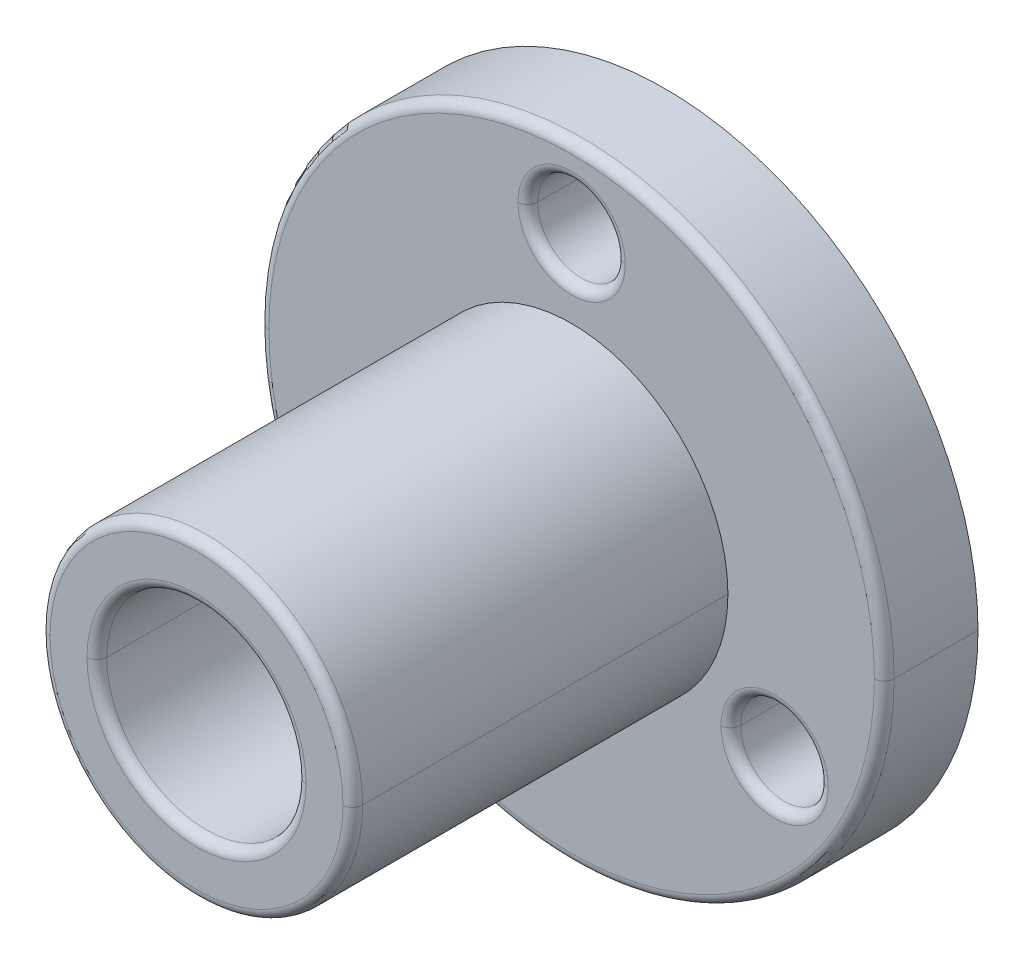
ISO-10303-21;
HEADER;
FILE_DESCRIPTION(('STEP AP214'),'2;1');
FILE_NAME('part.step','',(''),(''),'','','');
FILE_SCHEMA(('AUTOMOTIVE_DESIGN { 1 0 10303 214 1 1 1 1 }'));
ENDSEC;
DATA;
#1=APPLICATION_CONTEXT('core data for automotive mechanical design processes');
#2=APPLICATION_PROTOCOL_DEFINITION('international standard','automotive_design',2000,#1);
#3=PRODUCT_CONTEXT('',#1,'mechanical');
#4=PRODUCT('Part','Part','',(#3));
#5=PRODUCT_RELATED_PRODUCT_CATEGORY('part','',(#4));
#6=PRODUCT_DEFINITION_FORMATION('','',#4);
#7=PRODUCT_DEFINITION_CONTEXT('part definition',#1,'design');
#8=PRODUCT_DEFINITION('design','',#6,#7);
#9=PRODUCT_DEFINITION_SHAPE('','',#8);
#10=(LENGTH_UNIT() NAMED_UNIT(*) SI_UNIT(.MILLI.,.METRE.));
#11=(NAMED_UNIT(*) PLANE_ANGLE_UNIT() SI_UNIT($,.RADIAN.));
#12=(NAMED_UNIT(*) SI_UNIT($,.STERADIAN.) SOLID_ANGLE_UNIT());
#13=UNCERTAINTY_MEASURE_WITH_UNIT(LENGTH_MEASURE(1.E-05),#10,'distance_accuracy_value','');
#14=(GEOMETRIC_REPRESENTATION_CONTEXT(3) GLOBAL_UNCERTAINTY_ASSIGNED_CONTEXT((#13)) GLOBAL_UNIT_ASSIGNED_CONTEXT((#10,
#11,#12)) REPRESENTATION_CONTEXT('',''));
#15=CARTESIAN_POINT('',(0.,0.,0.));
#16=DIRECTION('',(0.,0.,1.));
#17=DIRECTION('',(1.,0.,0.));
#18=AXIS2_PLACEMENT_3D('',#15,#16,#17);
#19=CARTESIAN_POINT('',(0.,0.,102.65));
#20=DIRECTION('',(0.,0.,1.));
#21=DIRECTION('',(1.,0.,0.));
#22=AXIS2_PLACEMENT_3D('',#19,#20,#21);
#23=TOROIDAL_SURFACE('',#22,5.95,0.4);
#24=CARTESIAN_POINT('',(-5.95,0.,102.65));
#25=DIRECTION('',(0.,1.,0.));
#26=DIRECTION('',(-1.,0.,0.));
#27=AXIS2_PLACEMENT_3D('',#24,#25,#26);
#28=CIRCLE('',#27,0.4);
#29=CARTESIAN_POINT('',(-6.35,0.,102.65));
#30=VERTEX_POINT('',#29);
#31=CARTESIAN_POINT('',(-5.95,0.,103.05));
#32=VERTEX_POINT('',#31);
#33=EDGE_CURVE('E223',#30,#32,#28,.T.);
#34=ORIENTED_EDGE('',*,*,#33,.F.);
#35=CARTESIAN_POINT('',(0.,0.,102.65));
#36=DIRECTION('',(0.,0.,-1.));
#37=DIRECTION('',(1.,0.,0.));
#38=AXIS2_PLACEMENT_3D('',#35,#36,#37);
#39=CIRCLE('',#38,6.35);
#40=CARTESIAN_POINT('',(6.35,0.,102.65));
#41=VERTEX_POINT('',#40);
#42=EDGE_CURVE('E11',#41,#30,#39,.T.);
#43=ORIENTED_EDGE('',*,*,#42,.F.);
#44=CARTESIAN_POINT('',(5.95,0.,102.65));
#45=DIRECTION('',(0.,-1.,0.));
#46=DIRECTION('',(0.,0.,-1.));
#47=AXIS2_PLACEMENT_3D('',#44,#45,#46);
#48=CIRCLE('',#47,0.4);
#49=CARTESIAN_POINT('',(5.95,0.,103.05));
#50=VERTEX_POINT('',#49);
#51=EDGE_CURVE('E214',#41,#50,#48,.T.);
#52=ORIENTED_EDGE('',*,*,#51,.T.);
#53=CARTESIAN_POINT('',(0.,0.,103.05));
#54=DIRECTION('',(0.,0.,1.));
#55=DIRECTION('',(1.,0.,0.));
#56=AXIS2_PLACEMENT_3D('',#53,#54,#55);
#57=CIRCLE('',#56,5.95);
#58=EDGE_CURVE('E202',#32,#50,#57,.T.);
#59=ORIENTED_EDGE('',*,*,#58,.F.);
#60=EDGE_LOOP('',(#34,#43,#52,#59));
#61=FACE_BOUND('',#60,.T.);
#62=ADVANCED_FACE('F17',(#61),#23,.T.);
#63=CARTESIAN_POINT('',(0.,0.,102.65));
#64=DIRECTION('',(0.,0.,1.));
#65=DIRECTION('',(1.,0.,0.));
#66=AXIS2_PLACEMENT_3D('',#63,#64,#65);
#67=TOROIDAL_SURFACE('',#66,4.45,0.4);
#68=CARTESIAN_POINT('',(-4.45,0.,102.65));
#69=DIRECTION('',(0.,1.,0.));
#70=DIRECTION('',(-1.,0.,0.));
#71=AXIS2_PLACEMENT_3D('',#68,#69,#70);
#72=CIRCLE('',#71,0.4);
#73=CARTESIAN_POINT('',(-4.45,0.,103.05));
#74=VERTEX_POINT('',#73);
#75=CARTESIAN_POINT('',(-4.05,0.,102.65));
#76=VERTEX_POINT('',#75);
#77=EDGE_CURVE('E292',#74,#76,#72,.T.);
#78=ORIENTED_EDGE('',*,*,#77,.F.);
#79=CARTESIAN_POINT('',(0.,0.,103.05));
#80=DIRECTION('',(0.,0.,-1.));
#81=DIRECTION('',(1.,0.,0.));
#82=AXIS2_PLACEMENT_3D('',#79,#80,#81);
#83=CIRCLE('',#82,4.45);
#84=CARTESIAN_POINT('',(4.45,0.,103.05));
#85=VERTEX_POINT('',#84);
#86=EDGE_CURVE('E28',#85,#74,#83,.T.);
#87=ORIENTED_EDGE('',*,*,#86,.F.);
#88=CARTESIAN_POINT('',(4.45,0.,102.65));
#89=DIRECTION('',(0.,-1.,0.));
#90=DIRECTION('',(0.,0.,-1.));
#91=AXIS2_PLACEMENT_3D('',#88,#89,#90);
#92=CIRCLE('',#91,0.4);
#93=CARTESIAN_POINT('',(4.05,0.,102.65));
#94=VERTEX_POINT('',#93);
#95=EDGE_CURVE('E347',#85,#94,#92,.T.);
#96=ORIENTED_EDGE('',*,*,#95,.T.);
#97=CARTESIAN_POINT('',(0.,0.,102.65));
#98=DIRECTION('',(0.,0.,1.));
#99=DIRECTION('',(1.,0.,0.));
#100=AXIS2_PLACEMENT_3D('',#97,#98,#99);
#101=CIRCLE('',#100,4.05);
#102=EDGE_CURVE('E259',#76,#94,#101,.T.);
#103=ORIENTED_EDGE('',*,*,#102,.F.);
#104=EDGE_LOOP('',(#78,#87,#96,#103));
#105=FACE_BOUND('',#104,.T.);
#106=ADVANCED_FACE('F19',(#105),#67,.T.);
#107=CARTESIAN_POINT('',(0.,0.,87.41));
#108=DIRECTION('',(0.,0.,1.));
#109=DIRECTION('',(1.,0.,0.));
#110=AXIS2_PLACEMENT_3D('',#107,#108,#109);
#111=TOROIDAL_SURFACE('',#110,12.3,0.4);
#112=CARTESIAN_POINT('',(-12.3,0.,87.41));
#113=DIRECTION('',(0.,1.,0.));
#114=DIRECTION('',(-1.,0.,0.));
#115=AXIS2_PLACEMENT_3D('',#112,#113,#114);
#116=CIRCLE('',#115,0.4);
#117=CARTESIAN_POINT('',(-12.7,0.,87.41));
#118=VERTEX_POINT('',#117);
#119=CARTESIAN_POINT('',(-12.3,0.,87.81));
#120=VERTEX_POINT('',#119);
#121=EDGE_CURVE('E260',#118,#120,#116,.T.);
#122=ORIENTED_EDGE('',*,*,#121,.F.);
#123=CARTESIAN_POINT('',(0.,0.,87.41));
#124=DIRECTION('',(0.,0.,-1.));
#125=DIRECTION('',(1.,0.,0.));
#126=AXIS2_PLACEMENT_3D('',#123,#124,#125);
#127=CIRCLE('',#126,12.7);
#128=CARTESIAN_POINT('',(12.7,0.,87.41));
#129=VERTEX_POINT('',#128);
#130=EDGE_CURVE('E320',#129,#118,#127,.T.);
#131=ORIENTED_EDGE('',*,*,#130,.F.);
#132=CARTESIAN_POINT('',(12.3,0.,87.41));
#133=DIRECTION('',(0.,-1.,0.));
#134=DIRECTION('',(0.,0.,-1.));
#135=AXIS2_PLACEMENT_3D('',#132,#133,#134);
#136=CIRCLE('',#135,0.4);
#137=CARTESIAN_POINT('',(12.3,0.,87.81));
#138=VERTEX_POINT('',#137);
#139=EDGE_CURVE('E305',#129,#138,#136,.T.);
#140=ORIENTED_EDGE('',*,*,#139,.T.);
#141=CARTESIAN_POINT('',(0.,0.,87.81));
#142=DIRECTION('',(0.,0.,1.));
#143=DIRECTION('',(1.,0.,0.));
#144=AXIS2_PLACEMENT_3D('',#141,#142,#143);
#145=CIRCLE('',#144,12.3);
#146=EDGE_CURVE('E277',#120,#138,#145,.T.);
#147=ORIENTED_EDGE('',*,*,#146,.F.);
#148=EDGE_LOOP('',(#122,#131,#140,#147));
#149=FACE_BOUND('',#148,.T.);
#150=ADVANCED_FACE('F627',(#149),#111,.T.);
#151=CARTESIAN_POINT('',(0.,9.525,87.41));
#152=DIRECTION('',(0.,0.,1.));
#153=DIRECTION('',(1.,0.,0.));
#154=AXIS2_PLACEMENT_3D('',#151,#152,#153);
#155=TOROIDAL_SURFACE('',#154,2.18000000000077,0.4);
#156=CARTESIAN_POINT('',(-2.18000000000077,9.525,87.41));
#157=DIRECTION('',(0.,1.,0.));
#158=DIRECTION('',(-1.,0.,0.));
#159=AXIS2_PLACEMENT_3D('',#156,#157,#158);
#160=CIRCLE('',#159,0.4);
#161=CARTESIAN_POINT('',(-2.18000000000077,9.525,87.81));
#162=VERTEX_POINT('',#161);
#163=CARTESIAN_POINT('',(-1.78000000000077,9.525,87.41));
#164=VERTEX_POINT('',#163);
#165=EDGE_CURVE('E296',#162,#164,#160,.T.);
#166=ORIENTED_EDGE('',*,*,#165,.F.);
#167=CARTESIAN_POINT('',(0.,9.525,87.81));
#168=DIRECTION('',(0.,0.,-1.));
#169=DIRECTION('',(1.,0.,0.));
#170=AXIS2_PLACEMENT_3D('',#167,#168,#169);
#171=CIRCLE('',#170,2.18000000000077);
#172=CARTESIAN_POINT('',(2.18000000000077,9.525,87.81));
#173=VERTEX_POINT('',#172);
#174=EDGE_CURVE('E284',#173,#162,#171,.T.);
#175=ORIENTED_EDGE('',*,*,#174,.F.);
#176=CARTESIAN_POINT('',(2.18000000000077,9.525,87.41));
#177=DIRECTION('',(0.,-1.,0.));
#178=DIRECTION('',(0.,0.,-1.));
#179=AXIS2_PLACEMENT_3D('',#176,#177,#178);
#180=CIRCLE('',#179,0.4);
#181=CARTESIAN_POINT('',(1.78000000000077,9.525,87.41));
#182=VERTEX_POINT('',#181);
#183=EDGE_CURVE('E270',#173,#182,#180,.T.);
#184=ORIENTED_EDGE('',*,*,#183,.T.);
#185=CARTESIAN_POINT('',(0.,9.525,87.41));
#186=DIRECTION('',(0.,0.,1.));
#187=DIRECTION('',(1.,0.,0.));
#188=AXIS2_PLACEMENT_3D('',#185,#186,#187);
#189=CIRCLE('',#188,1.78000000000077);
#190=EDGE_CURVE('E250',#164,#182,#189,.T.);
#191=ORIENTED_EDGE('',*,*,#190,.F.);
#192=EDGE_LOOP('',(#166,#175,#184,#191));
#193=FACE_BOUND('',#192,.T.);
#194=ADVANCED_FACE('F632',(#193),#155,.T.);
#195=CARTESIAN_POINT('',(8.24889197104739,-4.76249999999964,87.41));
#196=DIRECTION('',(0.,0.,1.));
#197=DIRECTION('',(1.,0.,0.));
#198=AXIS2_PLACEMENT_3D('',#195,#196,#197);
#199=TOROIDAL_SURFACE('',#198,2.18000000000077,0.4);
#200=CARTESIAN_POINT('',(6.06889197104662,-4.76249999999964,87.41));
#201=DIRECTION('',(0.,1.,0.));
#202=DIRECTION('',(-1.,0.,0.));
#203=AXIS2_PLACEMENT_3D('',#200,#201,#202);
#204=CIRCLE('',#203,0.4);
#205=CARTESIAN_POINT('',(6.06889197104662,-4.76249999999964,87.81));
#206=VERTEX_POINT('',#205);
#207=CARTESIAN_POINT('',(6.46889197104662,-4.76249999999964,87.41));
#208=VERTEX_POINT('',#207);
#209=EDGE_CURVE('E234',#206,#208,#204,.T.);
#210=ORIENTED_EDGE('',*,*,#209,.F.);
#211=CARTESIAN_POINT('',(8.24889197104739,-4.76249999999964,87.81));
#212=DIRECTION('',(0.,0.,-1.));
#213=DIRECTION('',(1.,0.,0.));
#214=AXIS2_PLACEMENT_3D('',#211,#212,#213);
#215=CIRCLE('',#214,2.18000000000077);
#216=CARTESIAN_POINT('',(10.4288919710482,-4.76249999999964,87.81));
#217=VERTEX_POINT('',#216);
#218=EDGE_CURVE('E276',#217,#206,#215,.T.);
#219=ORIENTED_EDGE('',*,*,#218,.F.);
#220=CARTESIAN_POINT('',(10.4288919710482,-4.76249999999964,87.41));
#221=DIRECTION('',(0.,-1.,0.));
#222=DIRECTION('',(0.,0.,-1.));
#223=AXIS2_PLACEMENT_3D('',#220,#221,#222);
#224=CIRCLE('',#223,0.4);
#225=CARTESIAN_POINT('',(10.0288919710482,-4.76249999999964,87.41));
#226=VERTEX_POINT('',#225);
#227=EDGE_CURVE('E278',#217,#226,#224,.T.);
#228=ORIENTED_EDGE('',*,*,#227,.T.);
#229=CARTESIAN_POINT('',(8.24889197104739,-4.76249999999964,87.41));
#230=DIRECTION('',(0.,0.,1.));
#231=DIRECTION('',(1.,0.,0.));
#232=AXIS2_PLACEMENT_3D('',#229,#230,#231);
#233=CIRCLE('',#232,1.78000000000077);
#234=EDGE_CURVE('E352',#208,#226,#233,.T.);
#235=ORIENTED_EDGE('',*,*,#234,.F.);
#236=EDGE_LOOP('',(#210,#219,#228,#235));
#237=FACE_BOUND('',#236,.T.);
#238=ADVANCED_FACE('F450',(#237),#199,.T.);
#239=CARTESIAN_POINT('',(-8.24889197104617,-4.76250000000036,87.41));
#240=DIRECTION('',(0.,0.,1.));
#241=DIRECTION('',(1.,0.,0.));
#242=AXIS2_PLACEMENT_3D('',#239,#240,#241);
#243=TOROIDAL_SURFACE('',#242,2.18000000000077,0.4);
#244=CARTESIAN_POINT('',(-10.4288919710469,-4.76250000000036,87.41));
#245=DIRECTION('',(0.,1.,0.));
#246=DIRECTION('',(-1.,0.,0.));
#247=AXIS2_PLACEMENT_3D('',#244,#245,#246);
#248=CIRCLE('',#247,0.4);
#249=CARTESIAN_POINT('',(-10.4288919710469,-4.76250000000036,87.81));
#250=VERTEX_POINT('',#249);
#251=CARTESIAN_POINT('',(-10.0288919710469,-4.76250000000036,87.41));
#252=VERTEX_POINT('',#251);
#253=EDGE_CURVE('E332',#250,#252,#248,.T.);
#254=ORIENTED_EDGE('',*,*,#253,.F.);
#255=CARTESIAN_POINT('',(-8.24889197104617,-4.76250000000036,87.81));
#256=DIRECTION('',(0.,0.,-1.));
#257=DIRECTION('',(1.,0.,0.));
#258=AXIS2_PLACEMENT_3D('',#255,#256,#257);
#259=CIRCLE('',#258,2.18000000000077);
#260=CARTESIAN_POINT('',(-6.0688919710454,-4.76250000000036,87.81));
#261=VERTEX_POINT('',#260);
#262=EDGE_CURVE('E126',#261,#250,#259,.T.);
#263=ORIENTED_EDGE('',*,*,#262,.F.);
#264=CARTESIAN_POINT('',(-6.0688919710454,-4.76250000000036,87.41));
#265=DIRECTION('',(0.,-1.,0.));
#266=DIRECTION('',(0.,0.,-1.));
#267=AXIS2_PLACEMENT_3D('',#264,#265,#266);
#268=CIRCLE('',#267,0.4);
#269=CARTESIAN_POINT('',(-6.4688919710454,-4.76250000000036,87.41));
#270=VERTEX_POINT('',#269);
#271=EDGE_CURVE('E236',#261,#270,#268,.T.);
#272=ORIENTED_EDGE('',*,*,#271,.T.);
#273=CARTESIAN_POINT('',(-8.24889197104617,-4.76250000000036,87.41));
#274=DIRECTION('',(0.,0.,1.));
#275=DIRECTION('',(1.,0.,0.));
#276=AXIS2_PLACEMENT_3D('',#273,#274,#275);
#277=CIRCLE('',#276,1.78000000000077);
#278=EDGE_CURVE('E309',#252,#270,#277,.T.);
#279=ORIENTED_EDGE('',*,*,#278,.F.);
#280=EDGE_LOOP('',(#254,#263,#272,#279));
#281=FACE_BOUND('',#280,.T.);
#282=ADVANCED_FACE('F430',(#281),#243,.T.);
#283=CARTESIAN_POINT('',(0.,0.,103.05));
#284=DIRECTION('',(0.,0.,-1.));
#285=DIRECTION('',(-1.,0.,0.));
#286=AXIS2_PLACEMENT_3D('',#283,#284,#285);
#287=CYLINDRICAL_SURFACE('',#286,6.35);
#288=DIRECTION('',(0.,0.,-1.));
#289=VECTOR('',#288,1.);
#290=CARTESIAN_POINT('',(6.35,0.,103.05));
#291=LINE('',#290,#289);
#292=CARTESIAN_POINT('',(6.35,0.,87.81));
#293=VERTEX_POINT('',#292);
#294=EDGE_CURVE('E239',#41,#293,#291,.T.);
#295=ORIENTED_EDGE('',*,*,#294,.F.);
#296=ORIENTED_EDGE('',*,*,#42,.T.);
#297=DIRECTION('',(0.,0.,-1.));
#298=VECTOR('',#297,1.);
#299=CARTESIAN_POINT('',(-6.35,0.,103.05));
#300=LINE('',#299,#298);
#301=CARTESIAN_POINT('',(-6.35,0.,87.81));
#302=VERTEX_POINT('',#301);
#303=EDGE_CURVE('E342',#30,#302,#300,.T.);
#304=ORIENTED_EDGE('',*,*,#303,.T.);
#305=CARTESIAN_POINT('',(0.,0.,87.81));
#306=DIRECTION('',(0.,0.,1.));
#307=DIRECTION('',(1.,0.,0.));
#308=AXIS2_PLACEMENT_3D('',#305,#306,#307);
#309=CIRCLE('',#308,6.35);
#310=EDGE_CURVE('E287',#302,#293,#309,.T.);
#311=ORIENTED_EDGE('',*,*,#310,.T.);
#312=EDGE_LOOP('',(#295,#296,#304,#311));
#313=FACE_BOUND('',#312,.T.);
#314=ADVANCED_FACE('F564',(#313),#287,.T.);
#315=CARTESIAN_POINT('',(0.,0.,103.05));
#316=DIRECTION('',(0.,0.,1.));
#317=DIRECTION('',(1.,0.,0.));
#318=AXIS2_PLACEMENT_3D('',#315,#316,#317);
#319=PLANE('',#318);
#320=ORIENTED_EDGE('',*,*,#86,.T.);
#321=CARTESIAN_POINT('',(0.,0.,103.05));
#322=DIRECTION('',(0.,0.,-1.));
#323=DIRECTION('',(1.,0.,0.));
#324=AXIS2_PLACEMENT_3D('',#321,#322,#323);
#325=CIRCLE('',#324,4.45);
#326=EDGE_CURVE('E220',#74,#85,#325,.T.);
#327=ORIENTED_EDGE('',*,*,#326,.T.);
#328=EDGE_LOOP('',(#320,#327));
#329=FACE_BOUND('',#328,.T.);
#330=CARTESIAN_POINT('',(0.,0.,103.05));
#331=DIRECTION('',(0.,0.,1.));
#332=DIRECTION('',(1.,0.,0.));
#333=AXIS2_PLACEMENT_3D('',#330,#331,#332);
#334=CIRCLE('',#333,5.95);
#335=EDGE_CURVE('E206',#50,#32,#334,.T.);
#336=ORIENTED_EDGE('',*,*,#335,.T.);
#337=ORIENTED_EDGE('',*,*,#58,.T.);
#338=EDGE_LOOP('',(#336,#337));
#339=FACE_BOUND('',#338,.T.);
#340=ADVANCED_FACE('F204',(#329,#339),#319,.T.);
#341=CARTESIAN_POINT('',(0.,0.,84.));
#342=DIRECTION('',(0.,0.,1.));
#343=DIRECTION('',(1.,0.,0.));
#344=AXIS2_PLACEMENT_3D('',#341,#342,#343);
#345=PLANE('',#344);
#346=CARTESIAN_POINT('',(0.,0.,84.));
#347=DIRECTION('',(0.,0.,1.));
#348=DIRECTION('',(1.,0.,0.));
#349=AXIS2_PLACEMENT_3D('',#346,#347,#348);
#350=CIRCLE('',#349,4.05);
#351=CARTESIAN_POINT('',(-4.05,0.,84.));
#352=VERTEX_POINT('',#351);
#353=CARTESIAN_POINT('',(4.05,0.,84.));
#354=VERTEX_POINT('',#353);
#355=EDGE_CURVE('E258',#352,#354,#350,.T.);
#356=ORIENTED_EDGE('',*,*,#355,.T.);
#357=CARTESIAN_POINT('',(0.,0.,84.));
#358=DIRECTION('',(0.,0.,1.));
#359=DIRECTION('',(1.,0.,0.));
#360=AXIS2_PLACEMENT_3D('',#357,#358,#359);
#361=CIRCLE('',#360,4.05);
#362=EDGE_CURVE('E211',#354,#352,#361,.T.);
#363=ORIENTED_EDGE('',*,*,#362,.T.);
#364=EDGE_LOOP('',(#356,#363));
#365=FACE_BOUND('',#364,.T.);
#366=CARTESIAN_POINT('',(8.24889197104739,-4.76249999999964,84.));
#367=DIRECTION('',(0.,0.,1.));
#368=DIRECTION('',(1.,0.,0.));
#369=AXIS2_PLACEMENT_3D('',#366,#367,#368);
#370=CIRCLE('',#369,1.78000000000077);
#371=CARTESIAN_POINT('',(6.46889197104662,-4.76249999999964,84.));
#372=VERTEX_POINT('',#371);
#373=CARTESIAN_POINT('',(10.0288919710482,-4.76249999999964,84.));
#374=VERTEX_POINT('',#373);
#375=EDGE_CURVE('E316',#372,#374,#370,.T.);
#376=ORIENTED_EDGE('',*,*,#375,.T.);
#377=CARTESIAN_POINT('',(8.24889197104739,-4.76249999999964,84.));
#378=DIRECTION('',(0.,0.,1.));
#379=DIRECTION('',(1.,0.,0.));
#380=AXIS2_PLACEMENT_3D('',#377,#378,#379);
#381=CIRCLE('',#380,1.78000000000077);
#382=EDGE_CURVE('E21',#374,#372,#381,.T.);
#383=ORIENTED_EDGE('',*,*,#382,.T.);
#384=EDGE_LOOP('',(#376,#383));
#385=FACE_BOUND('',#384,.T.);
#386=CARTESIAN_POINT('',(0.,9.525,84.));
#387=DIRECTION('',(0.,0.,1.));
#388=DIRECTION('',(1.,0.,0.));
#389=AXIS2_PLACEMENT_3D('',#386,#387,#388);
#390=CIRCLE('',#389,1.78000000000077);
#391=CARTESIAN_POINT('',(-1.78000000000077,9.525,84.));
#392=VERTEX_POINT('',#391);
#393=CARTESIAN_POINT('',(1.78000000000077,9.525,84.));
#394=VERTEX_POINT('',#393);
#395=EDGE_CURVE('E249',#392,#394,#390,.T.);
#396=ORIENTED_EDGE('',*,*,#395,.T.);
#397=CARTESIAN_POINT('',(0.,9.525,84.));
#398=DIRECTION('',(0.,0.,1.));
#399=DIRECTION('',(1.,0.,0.));
#400=AXIS2_PLACEMENT_3D('',#397,#398,#399);
#401=CIRCLE('',#400,1.78000000000077);
#402=EDGE_CURVE('E288',#394,#392,#401,.T.);
#403=ORIENTED_EDGE('',*,*,#402,.T.);
#404=EDGE_LOOP('',(#396,#403));
#405=FACE_BOUND('',#404,.T.);
#406=CARTESIAN_POINT('',(-8.24889197104617,-4.76250000000036,84.));
#407=DIRECTION('',(0.,0.,1.));
#408=DIRECTION('',(1.,0.,0.));
#409=AXIS2_PLACEMENT_3D('',#406,#407,#408);
#410=CIRCLE('',#409,1.78000000000077);
#411=CARTESIAN_POINT('',(-10.0288919710469,-4.76250000000036,84.));
#412=VERTEX_POINT('',#411);
#413=CARTESIAN_POINT('',(-6.4688919710454,-4.76250000000036,84.));
#414=VERTEX_POINT('',#413);
#415=EDGE_CURVE('E241',#412,#414,#410,.T.);
#416=ORIENTED_EDGE('',*,*,#415,.T.);
#417=CARTESIAN_POINT('',(-8.24889197104617,-4.76250000000036,84.));
#418=DIRECTION('',(0.,0.,1.));
#419=DIRECTION('',(1.,0.,0.));
#420=AXIS2_PLACEMENT_3D('',#417,#418,#419);
#421=CIRCLE('',#420,1.78000000000077);
#422=EDGE_CURVE('E291',#414,#412,#421,.T.);
#423=ORIENTED_EDGE('',*,*,#422,.T.);
#424=EDGE_LOOP('',(#416,#423));
#425=FACE_BOUND('',#424,.T.);
#426=CARTESIAN_POINT('',(0.,0.,84.));
#427=DIRECTION('',(0.,0.,1.));
#428=DIRECTION('',(1.,0.,0.));
#429=AXIS2_PLACEMENT_3D('',#426,#427,#428);
#430=CIRCLE('',#429,12.7);
#431=CARTESIAN_POINT('',(-12.7,0.,84.));
#432=VERTEX_POINT('',#431);
#433=CARTESIAN_POINT('',(12.7,0.,84.));
#434=VERTEX_POINT('',#433);
#435=EDGE_CURVE('E42',#432,#434,#430,.T.);
#436=ORIENTED_EDGE('',*,*,#435,.F.);
#437=CARTESIAN_POINT('',(0.,0.,84.));
#438=DIRECTION('',(0.,0.,1.));
#439=DIRECTION('',(1.,0.,0.));
#440=AXIS2_PLACEMENT_3D('',#437,#438,#439);
#441=CIRCLE('',#440,12.7);
#442=EDGE_CURVE('E356',#434,#432,#441,.T.);
#443=ORIENTED_EDGE('',*,*,#442,.F.);
#444=EDGE_LOOP('',(#436,#443));
#445=FACE_BOUND('',#444,.T.);
#446=ADVANCED_FACE('F416',(#365,#385,#405,#425,#445),#345,.F.);
#447=CARTESIAN_POINT('',(0.,0.,87.81));
#448=DIRECTION('',(0.,0.,-1.));
#449=DIRECTION('',(-1.,0.,0.));
#450=AXIS2_PLACEMENT_3D('',#447,#448,#449);
#451=CYLINDRICAL_SURFACE('',#450,4.05);
#452=DIRECTION('',(0.,0.,-1.));
#453=VECTOR('',#452,1.);
#454=CARTESIAN_POINT('',(4.05,0.,87.81));
#455=LINE('',#454,#453);
#456=EDGE_CURVE('E254',#94,#354,#455,.T.);
#457=ORIENTED_EDGE('',*,*,#456,.F.);
#458=CARTESIAN_POINT('',(0.,0.,102.65));
#459=DIRECTION('',(0.,0.,1.));
#460=DIRECTION('',(1.,0.,0.));
#461=AXIS2_PLACEMENT_3D('',#458,#459,#460);
#462=CIRCLE('',#461,4.05);
#463=EDGE_CURVE('E295',#94,#76,#462,.T.);
#464=ORIENTED_EDGE('',*,*,#463,.T.);
#465=DIRECTION('',(0.,0.,-1.));
#466=VECTOR('',#465,1.);
#467=CARTESIAN_POINT('',(-4.05,0.,87.81));
#468=LINE('',#467,#466);
#469=EDGE_CURVE('E385',#76,#352,#468,.T.);
#470=ORIENTED_EDGE('',*,*,#469,.T.);
#471=ORIENTED_EDGE('',*,*,#362,.F.);
#472=EDGE_LOOP('',(#457,#464,#470,#471));
#473=FACE_BOUND('',#472,.T.);
#474=ADVANCED_FACE('F419',(#473),#451,.F.);
#475=CARTESIAN_POINT('',(-8.24889197104617,-4.76250000000036,87.81));
#476=DIRECTION('',(0.,0.,-1.));
#477=DIRECTION('',(-1.,0.,0.));
#478=AXIS2_PLACEMENT_3D('',#475,#476,#477);
#479=CYLINDRICAL_SURFACE('',#478,1.78000000000077);
#480=DIRECTION('',(0.,0.,-1.));
#481=VECTOR('',#480,1.);
#482=CARTESIAN_POINT('',(-6.4688919710454,-4.76250000000036,87.81));
#483=LINE('',#482,#481);
#484=EDGE_CURVE('E246',#270,#414,#483,.T.);
#485=ORIENTED_EDGE('',*,*,#484,.F.);
#486=CARTESIAN_POINT('',(-8.24889197104617,-4.76250000000036,87.41));
#487=DIRECTION('',(0.,0.,1.));
#488=DIRECTION('',(1.,0.,0.));
#489=AXIS2_PLACEMENT_3D('',#486,#487,#488);
#490=CIRCLE('',#489,1.78000000000077);
#491=EDGE_CURVE('E240',#270,#252,#490,.T.);
#492=ORIENTED_EDGE('',*,*,#491,.T.);
#493=DIRECTION('',(0.,0.,-1.));
#494=VECTOR('',#493,1.);
#495=CARTESIAN_POINT('',(-10.0288919710469,-4.76250000000036,87.81));
#496=LINE('',#495,#494);
#497=EDGE_CURVE('E245',#252,#412,#496,.T.);
#498=ORIENTED_EDGE('',*,*,#497,.T.);
#499=ORIENTED_EDGE('',*,*,#422,.F.);
#500=EDGE_LOOP('',(#485,#492,#498,#499));
#501=FACE_BOUND('',#500,.T.);
#502=ADVANCED_FACE('F428',(#501),#479,.F.);
#503=CARTESIAN_POINT('',(0.,9.525,87.81));
#504=DIRECTION('',(0.,0.,-1.));
#505=DIRECTION('',(-1.,0.,0.));
#506=AXIS2_PLACEMENT_3D('',#503,#504,#505);
#507=CYLINDRICAL_SURFACE('',#506,1.78000000000077);
#508=DIRECTION('',(0.,0.,-1.));
#509=VECTOR('',#508,1.);
#510=CARTESIAN_POINT('',(1.78000000000077,9.525,87.81));
#511=LINE('',#510,#509);
#512=EDGE_CURVE('E174',#182,#394,#511,.T.);
#513=ORIENTED_EDGE('',*,*,#512,.F.);
#514=CARTESIAN_POINT('',(0.,9.525,87.41));
#515=DIRECTION('',(0.,0.,1.));
#516=DIRECTION('',(1.,0.,0.));
#517=AXIS2_PLACEMENT_3D('',#514,#515,#516);
#518=CIRCLE('',#517,1.78000000000077);
#519=EDGE_CURVE('E300',#182,#164,#518,.T.);
#520=ORIENTED_EDGE('',*,*,#519,.T.);
#521=DIRECTION('',(0.,0.,-1.));
#522=VECTOR('',#521,1.);
#523=CARTESIAN_POINT('',(-1.78000000000077,9.525,87.81));
#524=LINE('',#523,#522);
#525=EDGE_CURVE('E183',#164,#392,#524,.T.);
#526=ORIENTED_EDGE('',*,*,#525,.T.);
#527=ORIENTED_EDGE('',*,*,#402,.F.);
#528=EDGE_LOOP('',(#513,#520,#526,#527));
#529=FACE_BOUND('',#528,.T.);
#530=ADVANCED_FACE('F412',(#529),#507,.F.);
#531=CARTESIAN_POINT('',(8.24889197104739,-4.76249999999964,87.81));
#532=DIRECTION('',(0.,0.,-1.));
#533=DIRECTION('',(-1.,0.,0.));
#534=AXIS2_PLACEMENT_3D('',#531,#532,#533);
#535=CYLINDRICAL_SURFACE('',#534,1.78000000000077);
#536=DIRECTION('',(0.,0.,-1.));
#537=VECTOR('',#536,1.);
#538=CARTESIAN_POINT('',(10.0288919710482,-4.76249999999964,87.81));
#539=LINE('',#538,#537);
#540=EDGE_CURVE('E348',#226,#374,#539,.T.);
#541=ORIENTED_EDGE('',*,*,#540,.F.);
#542=CARTESIAN_POINT('',(8.24889197104739,-4.76249999999964,87.41));
#543=DIRECTION('',(0.,0.,1.));
#544=DIRECTION('',(1.,0.,0.));
#545=AXIS2_PLACEMENT_3D('',#542,#543,#544);
#546=CIRCLE('',#545,1.78000000000077);
#547=EDGE_CURVE('E283',#226,#208,#546,.T.);
#548=ORIENTED_EDGE('',*,*,#547,.T.);
#549=DIRECTION('',(0.,0.,-1.));
#550=VECTOR('',#549,1.);
#551=CARTESIAN_POINT('',(6.46889197104662,-4.76249999999964,87.81));
#552=LINE('',#551,#550);
#553=EDGE_CURVE('E312',#208,#372,#552,.T.);
#554=ORIENTED_EDGE('',*,*,#553,.T.);
#555=ORIENTED_EDGE('',*,*,#382,.F.);
#556=EDGE_LOOP('',(#541,#548,#554,#555));
#557=FACE_BOUND('',#556,.T.);
#558=ADVANCED_FACE('F455',(#557),#535,.F.);
#559=CARTESIAN_POINT('',(0.,0.,87.81));
#560=DIRECTION('',(0.,0.,-1.));
#561=DIRECTION('',(-1.,0.,0.));
#562=AXIS2_PLACEMENT_3D('',#559,#560,#561);
#563=CYLINDRICAL_SURFACE('',#562,12.7);
#564=DIRECTION('',(0.,0.,-1.));
#565=VECTOR('',#564,1.);
#566=CARTESIAN_POINT('',(12.7,0.,87.81));
#567=LINE('',#566,#565);
#568=EDGE_CURVE('E315',#129,#434,#567,.T.);
#569=ORIENTED_EDGE('',*,*,#568,.F.);
#570=ORIENTED_EDGE('',*,*,#130,.T.);
#571=DIRECTION('',(0.,0.,-1.));
#572=VECTOR('',#571,1.);
#573=CARTESIAN_POINT('',(-12.7,0.,87.81));
#574=LINE('',#573,#572);
#575=EDGE_CURVE('E353',#118,#432,#574,.T.);
#576=ORIENTED_EDGE('',*,*,#575,.T.);
#577=ORIENTED_EDGE('',*,*,#435,.T.);
#578=EDGE_LOOP('',(#569,#570,#576,#577));
#579=FACE_BOUND('',#578,.T.);
#580=ADVANCED_FACE('F586',(#579),#563,.T.);
#581=CARTESIAN_POINT('',(0.,0.,87.81));
#582=DIRECTION('',(0.,0.,1.));
#583=DIRECTION('',(1.,0.,0.));
#584=AXIS2_PLACEMENT_3D('',#581,#582,#583);
#585=PLANE('',#584);
#586=ORIENTED_EDGE('',*,*,#310,.F.);
#587=CARTESIAN_POINT('',(0.,0.,87.81));
#588=DIRECTION('',(0.,0.,1.));
#589=DIRECTION('',(1.,0.,0.));
#590=AXIS2_PLACEMENT_3D('',#587,#588,#589);
#591=CIRCLE('',#590,6.35);
#592=EDGE_CURVE('E324',#293,#302,#591,.T.);
#593=ORIENTED_EDGE('',*,*,#592,.F.);
#594=EDGE_LOOP('',(#586,#593));
#595=FACE_BOUND('',#594,.T.);
#596=ORIENTED_EDGE('',*,*,#174,.T.);
#597=CARTESIAN_POINT('',(0.,9.525,87.81));
#598=DIRECTION('',(0.,0.,-1.));
#599=DIRECTION('',(1.,0.,0.));
#600=AXIS2_PLACEMENT_3D('',#597,#598,#599);
#601=CIRCLE('',#600,2.18000000000077);
#602=EDGE_CURVE('E301',#162,#173,#601,.T.);
#603=ORIENTED_EDGE('',*,*,#602,.T.);
#604=EDGE_LOOP('',(#596,#603));
#605=FACE_BOUND('',#604,.T.);
#606=ORIENTED_EDGE('',*,*,#218,.T.);
#607=CARTESIAN_POINT('',(8.24889197104739,-4.76249999999964,87.81));
#608=DIRECTION('',(0.,0.,-1.));
#609=DIRECTION('',(1.,0.,0.));
#610=AXIS2_PLACEMENT_3D('',#607,#608,#609);
#611=CIRCLE('',#610,2.18000000000077);
#612=EDGE_CURVE('E266',#206,#217,#611,.T.);
#613=ORIENTED_EDGE('',*,*,#612,.T.);
#614=EDGE_LOOP('',(#606,#613));
#615=FACE_BOUND('',#614,.T.);
#616=ORIENTED_EDGE('',*,*,#262,.T.);
#617=CARTESIAN_POINT('',(-8.24889197104617,-4.76250000000036,87.81));
#618=DIRECTION('',(0.,0.,-1.));
#619=DIRECTION('',(1.,0.,0.));
#620=AXIS2_PLACEMENT_3D('',#617,#618,#619);
#621=CIRCLE('',#620,2.18000000000077);
#622=EDGE_CURVE('E282',#250,#261,#621,.T.);
#623=ORIENTED_EDGE('',*,*,#622,.T.);
#624=EDGE_LOOP('',(#616,#623));
#625=FACE_BOUND('',#624,.T.);
#626=CARTESIAN_POINT('',(0.,0.,87.81));
#627=DIRECTION('',(0.,0.,1.));
#628=DIRECTION('',(1.,0.,0.));
#629=AXIS2_PLACEMENT_3D('',#626,#627,#628);
#630=CIRCLE('',#629,12.3);
#631=EDGE_CURVE('E264',#138,#120,#630,.T.);
#632=ORIENTED_EDGE('',*,*,#631,.T.);
#633=ORIENTED_EDGE('',*,*,#146,.T.);
#634=EDGE_LOOP('',(#632,#633));
#635=FACE_BOUND('',#634,.T.);
#636=ADVANCED_FACE('F444',(#595,#605,#615,#625,#635),#585,.T.);
#637=CARTESIAN_POINT('',(0.,0.,87.81));
#638=DIRECTION('',(0.,0.,-1.));
#639=DIRECTION('',(-1.,0.,0.));
#640=AXIS2_PLACEMENT_3D('',#637,#638,#639);
#641=CYLINDRICAL_SURFACE('',#640,12.7);
#642=CARTESIAN_POINT('',(0.,0.,87.41));
#643=DIRECTION('',(0.,0.,-1.));
#644=DIRECTION('',(1.,0.,0.));
#645=AXIS2_PLACEMENT_3D('',#642,#643,#644);
#646=CIRCLE('',#645,12.7);
#647=EDGE_CURVE('E265',#118,#129,#646,.T.);
#648=ORIENTED_EDGE('',*,*,#647,.T.);
#649=ORIENTED_EDGE('',*,*,#568,.T.);
#650=ORIENTED_EDGE('',*,*,#442,.T.);
#651=ORIENTED_EDGE('',*,*,#575,.F.);
#652=EDGE_LOOP('',(#648,#649,#650,#651));
#653=FACE_BOUND('',#652,.T.);
#654=ADVANCED_FACE('F740',(#653),#641,.T.);
#655=CARTESIAN_POINT('',(8.24889197104739,-4.76249999999964,87.81));
#656=DIRECTION('',(0.,0.,-1.));
#657=DIRECTION('',(-1.,0.,0.));
#658=AXIS2_PLACEMENT_3D('',#655,#656,#657);
#659=CYLINDRICAL_SURFACE('',#658,1.78000000000077);
#660=ORIENTED_EDGE('',*,*,#234,.T.);
#661=ORIENTED_EDGE('',*,*,#540,.T.);
#662=ORIENTED_EDGE('',*,*,#375,.F.);
#663=ORIENTED_EDGE('',*,*,#553,.F.);
#664=EDGE_LOOP('',(#660,#661,#662,#663));
#665=FACE_BOUND('',#664,.T.);
#666=ADVANCED_FACE('F458',(#665),#659,.F.);
#667=CARTESIAN_POINT('',(0.,9.525,87.81));
#668=DIRECTION('',(0.,0.,-1.));
#669=DIRECTION('',(-1.,0.,0.));
#670=AXIS2_PLACEMENT_3D('',#667,#668,#669);
#671=CYLINDRICAL_SURFACE('',#670,1.78000000000077);
#672=ORIENTED_EDGE('',*,*,#190,.T.);
#673=ORIENTED_EDGE('',*,*,#512,.T.);
#674=ORIENTED_EDGE('',*,*,#395,.F.);
#675=ORIENTED_EDGE('',*,*,#525,.F.);
#676=EDGE_LOOP('',(#672,#673,#674,#675));
#677=FACE_BOUND('',#676,.T.);
#678=ADVANCED_FACE('F414',(#677),#671,.F.);
#679=CARTESIAN_POINT('',(-8.24889197104617,-4.76250000000036,87.81));
#680=DIRECTION('',(0.,0.,-1.));
#681=DIRECTION('',(-1.,0.,0.));
#682=AXIS2_PLACEMENT_3D('',#679,#680,#681);
#683=CYLINDRICAL_SURFACE('',#682,1.78000000000077);
#684=ORIENTED_EDGE('',*,*,#278,.T.);
#685=ORIENTED_EDGE('',*,*,#484,.T.);
#686=ORIENTED_EDGE('',*,*,#415,.F.);
#687=ORIENTED_EDGE('',*,*,#497,.F.);
#688=EDGE_LOOP('',(#684,#685,#686,#687));
#689=FACE_BOUND('',#688,.T.);
#690=ADVANCED_FACE('F424',(#689),#683,.F.);
#691=CARTESIAN_POINT('',(0.,0.,87.81));
#692=DIRECTION('',(0.,0.,-1.));
#693=DIRECTION('',(-1.,0.,0.));
#694=AXIS2_PLACEMENT_3D('',#691,#692,#693);
#695=CYLINDRICAL_SURFACE('',#694,4.05);
#696=ORIENTED_EDGE('',*,*,#102,.T.);
#697=ORIENTED_EDGE('',*,*,#456,.T.);
#698=ORIENTED_EDGE('',*,*,#355,.F.);
#699=ORIENTED_EDGE('',*,*,#469,.F.);
#700=EDGE_LOOP('',(#696,#697,#698,#699));
#701=FACE_BOUND('',#700,.T.);
#702=ADVANCED_FACE('F600',(#701),#695,.F.);
#703=CARTESIAN_POINT('',(0.,0.,103.05));
#704=DIRECTION('',(0.,0.,-1.));
#705=DIRECTION('',(-1.,0.,0.));
#706=AXIS2_PLACEMENT_3D('',#703,#704,#705);
#707=CYLINDRICAL_SURFACE('',#706,6.35);
#708=CARTESIAN_POINT('',(0.,0.,102.65));
#709=DIRECTION('',(0.,0.,-1.));
#710=DIRECTION('',(1.,0.,0.));
#711=AXIS2_PLACEMENT_3D('',#708,#709,#710);
#712=CIRCLE('',#711,6.35);
#713=EDGE_CURVE('E230',#30,#41,#712,.T.);
#714=ORIENTED_EDGE('',*,*,#713,.T.);
#715=ORIENTED_EDGE('',*,*,#294,.T.);
#716=ORIENTED_EDGE('',*,*,#592,.T.);
#717=ORIENTED_EDGE('',*,*,#303,.F.);
#718=EDGE_LOOP('',(#714,#715,#716,#717));
#719=FACE_BOUND('',#718,.T.);
#720=ADVANCED_FACE('F540',(#719),#707,.T.);
#721=CARTESIAN_POINT('',(-8.24889197104617,-4.76250000000036,87.41));
#722=DIRECTION('',(0.,0.,1.));
#723=DIRECTION('',(1.,0.,0.));
#724=AXIS2_PLACEMENT_3D('',#721,#722,#723);
#725=TOROIDAL_SURFACE('',#724,2.18000000000077,0.4);
#726=ORIENTED_EDGE('',*,*,#622,.F.);
#727=ORIENTED_EDGE('',*,*,#253,.T.);
#728=ORIENTED_EDGE('',*,*,#491,.F.);
#729=ORIENTED_EDGE('',*,*,#271,.F.);
#730=EDGE_LOOP('',(#726,#727,#728,#729));
#731=FACE_BOUND('',#730,.T.);
#732=ADVANCED_FACE('F433',(#731),#725,.T.);
#733=CARTESIAN_POINT('',(8.24889197104739,-4.76249999999964,87.41));
#734=DIRECTION('',(0.,0.,1.));
#735=DIRECTION('',(1.,0.,0.));
#736=AXIS2_PLACEMENT_3D('',#733,#734,#735);
#737=TOROIDAL_SURFACE('',#736,2.18000000000077,0.4);
#738=ORIENTED_EDGE('',*,*,#612,.F.);
#739=ORIENTED_EDGE('',*,*,#209,.T.);
#740=ORIENTED_EDGE('',*,*,#547,.F.);
#741=ORIENTED_EDGE('',*,*,#227,.F.);
#742=EDGE_LOOP('',(#738,#739,#740,#741));
#743=FACE_BOUND('',#742,.T.);
#744=ADVANCED_FACE('F453',(#743),#737,.T.);
#745=CARTESIAN_POINT('',(0.,9.525,87.41));
#746=DIRECTION('',(0.,0.,1.));
#747=DIRECTION('',(1.,0.,0.));
#748=AXIS2_PLACEMENT_3D('',#745,#746,#747);
#749=TOROIDAL_SURFACE('',#748,2.18000000000077,0.4);
#750=ORIENTED_EDGE('',*,*,#602,.F.);
#751=ORIENTED_EDGE('',*,*,#165,.T.);
#752=ORIENTED_EDGE('',*,*,#519,.F.);
#753=ORIENTED_EDGE('',*,*,#183,.F.);
#754=EDGE_LOOP('',(#750,#751,#752,#753));
#755=FACE_BOUND('',#754,.T.);
#756=ADVANCED_FACE('F490',(#755),#749,.T.);
#757=CARTESIAN_POINT('',(0.,0.,87.41));
#758=DIRECTION('',(0.,0.,1.));
#759=DIRECTION('',(1.,0.,0.));
#760=AXIS2_PLACEMENT_3D('',#757,#758,#759);
#761=TOROIDAL_SURFACE('',#760,12.3,0.4);
#762=ORIENTED_EDGE('',*,*,#647,.F.);
#763=ORIENTED_EDGE('',*,*,#121,.T.);
#764=ORIENTED_EDGE('',*,*,#631,.F.);
#765=ORIENTED_EDGE('',*,*,#139,.F.);
#766=EDGE_LOOP('',(#762,#763,#764,#765));
#767=FACE_BOUND('',#766,.T.);
#768=ADVANCED_FACE('F500',(#767),#761,.T.);
#769=CARTESIAN_POINT('',(0.,0.,102.65));
#770=DIRECTION('',(0.,0.,1.));
#771=DIRECTION('',(1.,0.,0.));
#772=AXIS2_PLACEMENT_3D('',#769,#770,#771);
#773=TOROIDAL_SURFACE('',#772,4.45,0.4);
#774=ORIENTED_EDGE('',*,*,#326,.F.);
#775=ORIENTED_EDGE('',*,*,#77,.T.);
#776=ORIENTED_EDGE('',*,*,#463,.F.);
#777=ORIENTED_EDGE('',*,*,#95,.F.);
#778=EDGE_LOOP('',(#774,#775,#776,#777));
#779=FACE_BOUND('',#778,.T.);
#780=ADVANCED_FACE('F476',(#779),#773,.T.);
#781=CARTESIAN_POINT('',(0.,0.,102.65));
#782=DIRECTION('',(0.,0.,1.));
#783=DIRECTION('',(1.,0.,0.));
#784=AXIS2_PLACEMENT_3D('',#781,#782,#783);
#785=TOROIDAL_SURFACE('',#784,5.95,0.4);
#786=ORIENTED_EDGE('',*,*,#713,.F.);
#787=ORIENTED_EDGE('',*,*,#33,.T.);
#788=ORIENTED_EDGE('',*,*,#335,.F.);
#789=ORIENTED_EDGE('',*,*,#51,.F.);
#790=EDGE_LOOP('',(#786,#787,#788,#789));
#791=FACE_BOUND('',#790,.T.);
#792=ADVANCED_FACE('F222',(#791),#785,.T.);
#793=CLOSED_SHELL('',(#62,#106,#150,#194,#238,#282,#314,#340,#446,#474,#502,#530,#558,#580,#636,
#654,#666,#678,#690,#702,#720,#732,#744,#756,#768,#780,#792));
#794=MANIFOLD_SOLID_BREP('B1',#793);
#795=ADVANCED_BREP_SHAPE_REPRESENTATION('',(#18,#794),#14);
#796=SHAPE_DEFINITION_REPRESENTATION(#9,#795);
ENDSEC;
END-ISO-10303-21;
